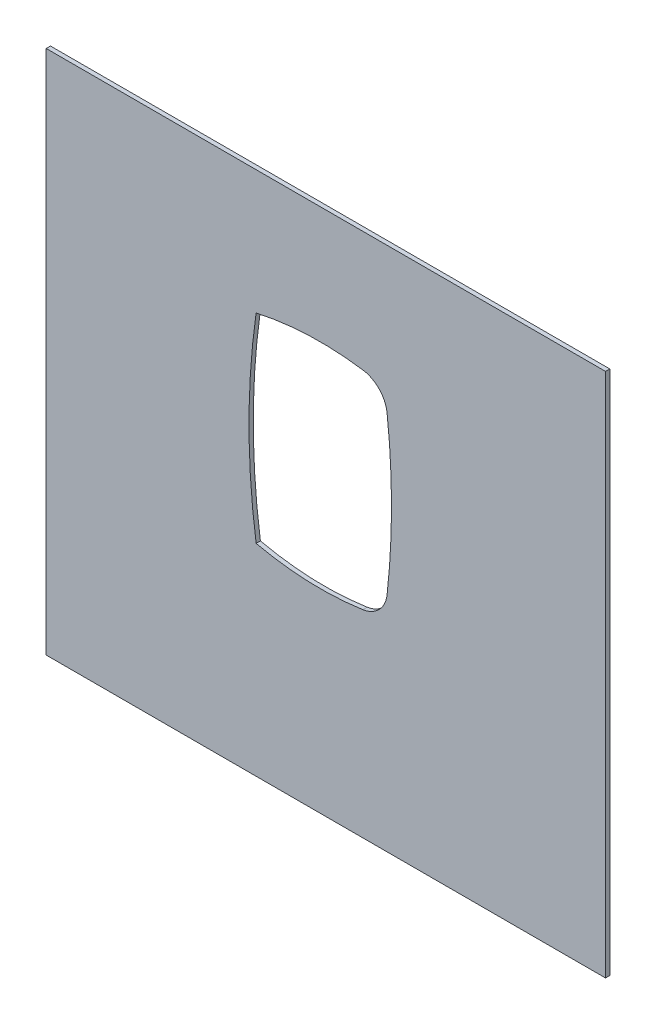
ISO-10303-21;
HEADER;
FILE_DESCRIPTION(('STEP AP214'),'2;1');
FILE_NAME('part.step','',(''),(''),'','','');
FILE_SCHEMA(('AUTOMOTIVE_DESIGN { 1 0 10303 214 1 1 1 1 }'));
ENDSEC;
DATA;
#1=APPLICATION_CONTEXT('core data for automotive mechanical design processes');
#2=APPLICATION_PROTOCOL_DEFINITION('international standard','automotive_design',2000,#1);
#3=PRODUCT_CONTEXT('',#1,'mechanical');
#4=PRODUCT('Part','Part','',(#3));
#5=PRODUCT_RELATED_PRODUCT_CATEGORY('part','',(#4));
#6=PRODUCT_DEFINITION_FORMATION('','',#4);
#7=PRODUCT_DEFINITION_CONTEXT('part definition',#1,'design');
#8=PRODUCT_DEFINITION('design','',#6,#7);
#9=PRODUCT_DEFINITION_SHAPE('','',#8);
#10=(LENGTH_UNIT() NAMED_UNIT(*) SI_UNIT(.MILLI.,.METRE.));
#11=(NAMED_UNIT(*) PLANE_ANGLE_UNIT() SI_UNIT($,.RADIAN.));
#12=(NAMED_UNIT(*) SI_UNIT($,.STERADIAN.) SOLID_ANGLE_UNIT());
#13=UNCERTAINTY_MEASURE_WITH_UNIT(LENGTH_MEASURE(1.E-05),#10,'distance_accuracy_value','');
#14=(GEOMETRIC_REPRESENTATION_CONTEXT(3) GLOBAL_UNCERTAINTY_ASSIGNED_CONTEXT((#13)) GLOBAL_UNIT_ASSIGNED_CONTEXT((#10,
#11,#12)) REPRESENTATION_CONTEXT('',''));
#15=CARTESIAN_POINT('',(0.,0.,0.));
#16=DIRECTION('',(0.,0.,1.));
#17=DIRECTION('',(1.,0.,0.));
#18=AXIS2_PLACEMENT_3D('',#15,#16,#17);
#19=CARTESIAN_POINT('',(0.,0.,3.));
#20=DIRECTION('',(0.,0.,1.));
#21=DIRECTION('',(1.,0.,0.));
#22=AXIS2_PLACEMENT_3D('',#19,#20,#21);
#23=PLANE('',#22);
#24=DIRECTION('',(0.,-1.,0.));
#25=VECTOR('',#24,1.);
#26=CARTESIAN_POINT('',(-192.273564140827,157.076579994882,3.));
#27=LINE('',#26,#25);
#28=CARTESIAN_POINT('',(-192.273564140827,157.076579994882,3.));
#29=VERTEX_POINT('',#28);
#30=CARTESIAN_POINT('',(-192.273564140827,-211.502758257767,3.));
#31=VERTEX_POINT('',#30);
#32=EDGE_CURVE('E161',#29,#31,#27,.T.);
#33=ORIENTED_EDGE('',*,*,#32,.T.);
#34=DIRECTION('',(1.,0.,0.));
#35=VECTOR('',#34,1.);
#36=CARTESIAN_POINT('',(-192.273564140827,-211.502758257767,3.));
#37=LINE('',#36,#35);
#38=CARTESIAN_POINT('',(200.136334774707,-211.502758257767,3.));
#39=VERTEX_POINT('',#38);
#40=EDGE_CURVE('E164',#31,#39,#37,.T.);
#41=ORIENTED_EDGE('',*,*,#40,.T.);
#42=DIRECTION('',(0.,1.,0.));
#43=VECTOR('',#42,1.);
#44=CARTESIAN_POINT('',(200.136334774707,157.076579994882,3.));
#45=LINE('',#44,#43);
#46=CARTESIAN_POINT('',(200.136334774707,157.076579994882,3.));
#47=VERTEX_POINT('',#46);
#48=EDGE_CURVE('E167',#39,#47,#45,.T.);
#49=ORIENTED_EDGE('',*,*,#48,.T.);
#50=DIRECTION('',(-1.,0.,0.));
#51=VECTOR('',#50,1.);
#52=CARTESIAN_POINT('',(-192.273564140827,157.076579994882,3.));
#53=LINE('',#52,#51);
#54=EDGE_CURVE('E169',#47,#29,#53,.T.);
#55=ORIENTED_EDGE('',*,*,#54,.T.);
#56=EDGE_LOOP('',(#33,#41,#49,#55));
#57=FACE_BOUND('',#56,.T.);
#58=CARTESIAN_POINT('',(0.,130.000000000001,3.));
#59=DIRECTION('',(0.,0.,1.));
#60=DIRECTION('',(1.,0.,0.));
#61=AXIS2_PLACEMENT_3D('',#58,#59,#60);
#62=CIRCLE('',#61,205.000000000001);
#63=CARTESIAN_POINT('',(-45.0000000000001,-70.0000000000001,3.));
#64=VERTEX_POINT('',#63);
#65=CARTESIAN_POINT('',(29.936886890584,-72.8023244524097,3.));
#66=VERTEX_POINT('',#65);
#67=EDGE_CURVE('E118',#64,#66,#62,.T.);
#68=ORIENTED_EDGE('',*,*,#67,.F.);
#69=CARTESIAN_POINT('',(442.5,0.,3.));
#70=DIRECTION('',(0.,0.,1.));
#71=DIRECTION('',(1.,0.,0.));
#72=AXIS2_PLACEMENT_3D('',#69,#70,#71);
#73=CIRCLE('',#72,492.500000000001);
#74=CARTESIAN_POINT('',(-45.0000000000018,69.9999999999999,3.));
#75=VERTEX_POINT('',#74);
#76=EDGE_CURVE('E110',#75,#64,#73,.T.);
#77=ORIENTED_EDGE('',*,*,#76,.F.);
#78=CARTESIAN_POINT('',(0.,-130.000000000001,3.));
#79=DIRECTION('',(0.,0.,1.));
#80=DIRECTION('',(1.,0.,0.));
#81=AXIS2_PLACEMENT_3D('',#78,#79,#80);
#82=CIRCLE('',#81,205.000000000001);
#83=CARTESIAN_POINT('',(29.9368868905842,72.8023244524097,3.));
#84=VERTEX_POINT('',#83);
#85=EDGE_CURVE('E139',#84,#75,#82,.T.);
#86=ORIENTED_EDGE('',*,*,#85,.F.);
#87=CARTESIAN_POINT('',(27.0162149988198,53.0167318229059,3.));
#88=DIRECTION('',(0.,0.,1.));
#89=DIRECTION('',(-1.,0.,0.));
#90=AXIS2_PLACEMENT_3D('',#87,#88,#89);
#91=CIRCLE('',#90,20.0000000000001);
#92=CARTESIAN_POINT('',(46.8899172209921,55.2608262916004,3.));
#93=VERTEX_POINT('',#92);
#94=EDGE_CURVE('E137',#93,#84,#91,.T.);
#95=ORIENTED_EDGE('',*,*,#94,.F.);
#96=CARTESIAN_POINT('',(-442.5,0.,3.));
#97=DIRECTION('',(0.,0.,1.));
#98=DIRECTION('',(1.,0.,0.));
#99=AXIS2_PLACEMENT_3D('',#96,#97,#98);
#100=CIRCLE('',#99,492.5);
#101=CARTESIAN_POINT('',(46.8899172209922,-55.2608262916006,3.));
#102=VERTEX_POINT('',#101);
#103=EDGE_CURVE('E133',#102,#93,#100,.T.);
#104=ORIENTED_EDGE('',*,*,#103,.F.);
#105=CARTESIAN_POINT('',(27.0162149988198,-53.0167318229061,3.));
#106=DIRECTION('',(0.,0.,1.));
#107=DIRECTION('',(1.,0.,0.));
#108=AXIS2_PLACEMENT_3D('',#105,#106,#107);
#109=CIRCLE('',#108,20.0000000000001);
#110=EDGE_CURVE('E131',#66,#102,#109,.T.);
#111=ORIENTED_EDGE('',*,*,#110,.F.);
#112=EDGE_LOOP('',(#68,#77,#86,#95,#104,#111));
#113=FACE_BOUND('',#112,.T.);
#114=ADVANCED_FACE('F33',(#57,#113),#23,.T.);
#115=CARTESIAN_POINT('',(0.,0.,0.));
#116=DIRECTION('',(0.,0.,1.));
#117=DIRECTION('',(1.,0.,0.));
#118=AXIS2_PLACEMENT_3D('',#115,#116,#117);
#119=PLANE('',#118);
#120=DIRECTION('',(0.,-1.,0.));
#121=VECTOR('',#120,1.);
#122=CARTESIAN_POINT('',(-192.273564140827,157.076579994882,0.));
#123=LINE('',#122,#121);
#124=CARTESIAN_POINT('',(-192.273564140827,157.076579994882,0.));
#125=VERTEX_POINT('',#124);
#126=CARTESIAN_POINT('',(-192.273564140827,-211.502758257767,0.));
#127=VERTEX_POINT('',#126);
#128=EDGE_CURVE('E126',#125,#127,#123,.T.);
#129=ORIENTED_EDGE('',*,*,#128,.F.);
#130=DIRECTION('',(-1.,0.,0.));
#131=VECTOR('',#130,1.);
#132=CARTESIAN_POINT('',(-192.273564140827,157.076579994882,0.));
#133=LINE('',#132,#131);
#134=CARTESIAN_POINT('',(200.136334774707,157.076579994882,0.));
#135=VERTEX_POINT('',#134);
#136=EDGE_CURVE('E165',#135,#125,#133,.T.);
#137=ORIENTED_EDGE('',*,*,#136,.F.);
#138=DIRECTION('',(0.,1.,0.));
#139=VECTOR('',#138,1.);
#140=CARTESIAN_POINT('',(200.136334774707,157.076579994882,0.));
#141=LINE('',#140,#139);
#142=CARTESIAN_POINT('',(200.136334774707,-211.502758257767,0.));
#143=VERTEX_POINT('',#142);
#144=EDGE_CURVE('E176',#143,#135,#141,.T.);
#145=ORIENTED_EDGE('',*,*,#144,.F.);
#146=DIRECTION('',(1.,0.,0.));
#147=VECTOR('',#146,1.);
#148=CARTESIAN_POINT('',(-192.273564140827,-211.502758257767,0.));
#149=LINE('',#148,#147);
#150=EDGE_CURVE('E174',#127,#143,#149,.T.);
#151=ORIENTED_EDGE('',*,*,#150,.F.);
#152=EDGE_LOOP('',(#129,#137,#145,#151));
#153=FACE_BOUND('',#152,.T.);
#154=CARTESIAN_POINT('',(442.5,0.,0.));
#155=DIRECTION('',(0.,0.,1.));
#156=DIRECTION('',(1.,0.,0.));
#157=AXIS2_PLACEMENT_3D('',#154,#155,#156);
#158=CIRCLE('',#157,492.500000000001);
#159=CARTESIAN_POINT('',(-45.0000000000018,69.9999999999999,0.));
#160=VERTEX_POINT('',#159);
#161=CARTESIAN_POINT('',(-45.0000000000001,-70.0000000000001,0.));
#162=VERTEX_POINT('',#161);
#163=EDGE_CURVE('E56',#160,#162,#158,.T.);
#164=ORIENTED_EDGE('',*,*,#163,.T.);
#165=CARTESIAN_POINT('',(0.,130.000000000001,0.));
#166=DIRECTION('',(0.,0.,1.));
#167=DIRECTION('',(1.,0.,0.));
#168=AXIS2_PLACEMENT_3D('',#165,#166,#167);
#169=CIRCLE('',#168,205.000000000001);
#170=CARTESIAN_POINT('',(29.936886890584,-72.8023244524097,0.));
#171=VERTEX_POINT('',#170);
#172=EDGE_CURVE('E125',#162,#171,#169,.T.);
#173=ORIENTED_EDGE('',*,*,#172,.T.);
#174=CARTESIAN_POINT('',(27.0162149988198,-53.0167318229061,0.));
#175=DIRECTION('',(0.,0.,1.));
#176=DIRECTION('',(1.,0.,0.));
#177=AXIS2_PLACEMENT_3D('',#174,#175,#176);
#178=CIRCLE('',#177,20.0000000000001);
#179=CARTESIAN_POINT('',(46.8899172209922,-55.2608262916006,0.));
#180=VERTEX_POINT('',#179);
#181=EDGE_CURVE('E143',#171,#180,#178,.T.);
#182=ORIENTED_EDGE('',*,*,#181,.T.);
#183=CARTESIAN_POINT('',(-442.5,0.,0.));
#184=DIRECTION('',(0.,0.,1.));
#185=DIRECTION('',(1.,0.,0.));
#186=AXIS2_PLACEMENT_3D('',#183,#184,#185);
#187=CIRCLE('',#186,492.5);
#188=CARTESIAN_POINT('',(46.8899172209921,55.2608262916004,0.));
#189=VERTEX_POINT('',#188);
#190=EDGE_CURVE('E146',#180,#189,#187,.T.);
#191=ORIENTED_EDGE('',*,*,#190,.T.);
#192=CARTESIAN_POINT('',(27.0162149988198,53.0167318229059,0.));
#193=DIRECTION('',(0.,0.,1.));
#194=DIRECTION('',(-1.,0.,0.));
#195=AXIS2_PLACEMENT_3D('',#192,#193,#194);
#196=CIRCLE('',#195,20.0000000000001);
#197=CARTESIAN_POINT('',(29.9368868905841,72.8023244524094,0.));
#198=VERTEX_POINT('',#197);
#199=EDGE_CURVE('E149',#189,#198,#196,.T.);
#200=ORIENTED_EDGE('',*,*,#199,.T.);
#201=CARTESIAN_POINT('',(0.,-130.000000000001,0.));
#202=DIRECTION('',(0.,0.,1.));
#203=DIRECTION('',(1.,0.,0.));
#204=AXIS2_PLACEMENT_3D('',#201,#202,#203);
#205=CIRCLE('',#204,205.000000000001);
#206=EDGE_CURVE('E119',#198,#160,#205,.T.);
#207=ORIENTED_EDGE('',*,*,#206,.T.);
#208=EDGE_LOOP('',(#164,#173,#182,#191,#200,#207));
#209=FACE_BOUND('',#208,.T.);
#210=ADVANCED_FACE('F194',(#153,#209),#119,.F.);
#211=CARTESIAN_POINT('',(-192.273564140827,157.076579994882,3.));
#212=DIRECTION('',(1.,0.,0.));
#213=DIRECTION('',(0.,0.,-1.));
#214=AXIS2_PLACEMENT_3D('',#211,#212,#213);
#215=PLANE('',#214);
#216=ORIENTED_EDGE('',*,*,#128,.T.);
#217=DIRECTION('',(0.,0.,-1.));
#218=VECTOR('',#217,1.);
#219=CARTESIAN_POINT('',(-192.273564140827,-211.502758257767,3.));
#220=LINE('',#219,#218);
#221=EDGE_CURVE('E11',#31,#127,#220,.T.);
#222=ORIENTED_EDGE('',*,*,#221,.F.);
#223=ORIENTED_EDGE('',*,*,#32,.F.);
#224=DIRECTION('',(0.,0.,-1.));
#225=VECTOR('',#224,1.);
#226=CARTESIAN_POINT('',(-192.273564140827,157.076579994882,3.));
#227=LINE('',#226,#225);
#228=EDGE_CURVE('E171',#29,#125,#227,.T.);
#229=ORIENTED_EDGE('',*,*,#228,.T.);
#230=EDGE_LOOP('',(#216,#222,#223,#229));
#231=FACE_BOUND('',#230,.T.);
#232=ADVANCED_FACE('F35',(#231),#215,.F.);
#233=CARTESIAN_POINT('',(-192.273564140827,-211.502758257767,3.));
#234=DIRECTION('',(0.,1.,0.));
#235=DIRECTION('',(0.,0.,1.));
#236=AXIS2_PLACEMENT_3D('',#233,#234,#235);
#237=PLANE('',#236);
#238=ORIENTED_EDGE('',*,*,#150,.T.);
#239=DIRECTION('',(0.,0.,-1.));
#240=VECTOR('',#239,1.);
#241=CARTESIAN_POINT('',(200.136334774707,-211.502758257767,3.));
#242=LINE('',#241,#240);
#243=EDGE_CURVE('E41',#39,#143,#242,.T.);
#244=ORIENTED_EDGE('',*,*,#243,.F.);
#245=ORIENTED_EDGE('',*,*,#40,.F.);
#246=ORIENTED_EDGE('',*,*,#221,.T.);
#247=EDGE_LOOP('',(#238,#244,#245,#246));
#248=FACE_BOUND('',#247,.T.);
#249=ADVANCED_FACE('F204',(#248),#237,.F.);
#250=CARTESIAN_POINT('',(200.136334774707,157.076579994882,3.));
#251=DIRECTION('',(-1.,0.,0.));
#252=DIRECTION('',(0.,0.,1.));
#253=AXIS2_PLACEMENT_3D('',#250,#251,#252);
#254=PLANE('',#253);
#255=ORIENTED_EDGE('',*,*,#144,.T.);
#256=DIRECTION('',(0.,0.,-1.));
#257=VECTOR('',#256,1.);
#258=CARTESIAN_POINT('',(200.136334774707,157.076579994882,3.));
#259=LINE('',#258,#257);
#260=EDGE_CURVE('E181',#47,#135,#259,.T.);
#261=ORIENTED_EDGE('',*,*,#260,.F.);
#262=ORIENTED_EDGE('',*,*,#48,.F.);
#263=ORIENTED_EDGE('',*,*,#243,.T.);
#264=EDGE_LOOP('',(#255,#261,#262,#263));
#265=FACE_BOUND('',#264,.T.);
#266=ADVANCED_FACE('F188',(#265),#254,.F.);
#267=CARTESIAN_POINT('',(-192.273564140827,157.076579994882,3.));
#268=DIRECTION('',(0.,-1.,0.));
#269=DIRECTION('',(0.,0.,-1.));
#270=AXIS2_PLACEMENT_3D('',#267,#268,#269);
#271=PLANE('',#270);
#272=ORIENTED_EDGE('',*,*,#136,.T.);
#273=ORIENTED_EDGE('',*,*,#228,.F.);
#274=ORIENTED_EDGE('',*,*,#54,.F.);
#275=ORIENTED_EDGE('',*,*,#260,.T.);
#276=EDGE_LOOP('',(#272,#273,#274,#275));
#277=FACE_BOUND('',#276,.T.);
#278=ADVANCED_FACE('F198',(#277),#271,.F.);
#279=CARTESIAN_POINT('',(442.5,0.,3.));
#280=DIRECTION('',(0.,0.,-1.));
#281=DIRECTION('',(-1.,0.,0.));
#282=AXIS2_PLACEMENT_3D('',#279,#280,#281);
#283=CYLINDRICAL_SURFACE('',#282,492.500000000001);
#284=ORIENTED_EDGE('',*,*,#163,.F.);
#285=DIRECTION('',(0.,0.,-1.));
#286=VECTOR('',#285,1.);
#287=CARTESIAN_POINT('',(-45.0000000000018,69.9999999999999,3.));
#288=LINE('',#287,#286);
#289=EDGE_CURVE('E114',#75,#160,#288,.T.);
#290=ORIENTED_EDGE('',*,*,#289,.F.);
#291=ORIENTED_EDGE('',*,*,#76,.T.);
#292=DIRECTION('',(0.,0.,-1.));
#293=VECTOR('',#292,1.);
#294=CARTESIAN_POINT('',(-45.0000000000001,-70.0000000000001,3.));
#295=LINE('',#294,#293);
#296=EDGE_CURVE('E113',#64,#162,#295,.T.);
#297=ORIENTED_EDGE('',*,*,#296,.T.);
#298=EDGE_LOOP('',(#284,#290,#291,#297));
#299=FACE_BOUND('',#298,.T.);
#300=ADVANCED_FACE('F112',(#299),#283,.F.);
#301=CARTESIAN_POINT('',(0.,130.000000000001,3.));
#302=DIRECTION('',(0.,0.,-1.));
#303=DIRECTION('',(-1.,0.,0.));
#304=AXIS2_PLACEMENT_3D('',#301,#302,#303);
#305=CYLINDRICAL_SURFACE('',#304,205.000000000001);
#306=ORIENTED_EDGE('',*,*,#172,.F.);
#307=ORIENTED_EDGE('',*,*,#296,.F.);
#308=ORIENTED_EDGE('',*,*,#67,.T.);
#309=DIRECTION('',(0.,0.,-1.));
#310=VECTOR('',#309,1.);
#311=CARTESIAN_POINT('',(29.936886890584,-72.8023244524097,3.));
#312=LINE('',#311,#310);
#313=EDGE_CURVE('E127',#66,#171,#312,.T.);
#314=ORIENTED_EDGE('',*,*,#313,.T.);
#315=EDGE_LOOP('',(#306,#307,#308,#314));
#316=FACE_BOUND('',#315,.T.);
#317=ADVANCED_FACE('F122',(#316),#305,.F.);
#318=CARTESIAN_POINT('',(27.0162149988198,-53.0167318229061,3.));
#319=DIRECTION('',(0.,0.,-1.));
#320=DIRECTION('',(-1.,0.,0.));
#321=AXIS2_PLACEMENT_3D('',#318,#319,#320);
#322=CYLINDRICAL_SURFACE('',#321,20.0000000000001);
#323=ORIENTED_EDGE('',*,*,#181,.F.);
#324=ORIENTED_EDGE('',*,*,#313,.F.);
#325=ORIENTED_EDGE('',*,*,#110,.T.);
#326=DIRECTION('',(0.,0.,-1.));
#327=VECTOR('',#326,1.);
#328=CARTESIAN_POINT('',(46.8899172209922,-55.2608262916006,3.));
#329=LINE('',#328,#327);
#330=EDGE_CURVE('E158',#102,#180,#329,.T.);
#331=ORIENTED_EDGE('',*,*,#330,.T.);
#332=EDGE_LOOP('',(#323,#324,#325,#331));
#333=FACE_BOUND('',#332,.T.);
#334=ADVANCED_FACE('F227',(#333),#322,.F.);
#335=CARTESIAN_POINT('',(-442.5,0.,3.));
#336=DIRECTION('',(0.,0.,-1.));
#337=DIRECTION('',(-1.,0.,0.));
#338=AXIS2_PLACEMENT_3D('',#335,#336,#337);
#339=CYLINDRICAL_SURFACE('',#338,492.5);
#340=ORIENTED_EDGE('',*,*,#190,.F.);
#341=ORIENTED_EDGE('',*,*,#330,.F.);
#342=ORIENTED_EDGE('',*,*,#103,.T.);
#343=DIRECTION('',(0.,0.,-1.));
#344=VECTOR('',#343,1.);
#345=CARTESIAN_POINT('',(46.8899172209921,55.2608262916004,3.));
#346=LINE('',#345,#344);
#347=EDGE_CURVE('E156',#93,#189,#346,.T.);
#348=ORIENTED_EDGE('',*,*,#347,.T.);
#349=EDGE_LOOP('',(#340,#341,#342,#348));
#350=FACE_BOUND('',#349,.T.);
#351=ADVANCED_FACE('F231',(#350),#339,.F.);
#352=CARTESIAN_POINT('',(27.0162149988198,53.0167318229059,3.));
#353=DIRECTION('',(0.,0.,-1.));
#354=DIRECTION('',(-1.,0.,0.));
#355=AXIS2_PLACEMENT_3D('',#352,#353,#354);
#356=CYLINDRICAL_SURFACE('',#355,20.0000000000001);
#357=ORIENTED_EDGE('',*,*,#199,.F.);
#358=ORIENTED_EDGE('',*,*,#347,.F.);
#359=ORIENTED_EDGE('',*,*,#94,.T.);
#360=DIRECTION('',(0.,0.,-1.));
#361=VECTOR('',#360,1.);
#362=CARTESIAN_POINT('',(29.9368868905841,72.8023244524094,3.));
#363=LINE('',#362,#361);
#364=EDGE_CURVE('E48',#84,#198,#363,.T.);
#365=ORIENTED_EDGE('',*,*,#364,.T.);
#366=EDGE_LOOP('',(#357,#358,#359,#365));
#367=FACE_BOUND('',#366,.T.);
#368=ADVANCED_FACE('F237',(#367),#356,.F.);
#369=CARTESIAN_POINT('',(0.,-130.000000000001,3.));
#370=DIRECTION('',(0.,0.,-1.));
#371=DIRECTION('',(-1.,0.,0.));
#372=AXIS2_PLACEMENT_3D('',#369,#370,#371);
#373=CYLINDRICAL_SURFACE('',#372,205.000000000001);
#374=ORIENTED_EDGE('',*,*,#206,.F.);
#375=ORIENTED_EDGE('',*,*,#364,.F.);
#376=ORIENTED_EDGE('',*,*,#85,.T.);
#377=ORIENTED_EDGE('',*,*,#289,.T.);
#378=EDGE_LOOP('',(#374,#375,#376,#377));
#379=FACE_BOUND('',#378,.T.);
#380=ADVANCED_FACE('F241',(#379),#373,.F.);
#381=CLOSED_SHELL('',(#114,#210,#232,#249,#266,#278,#300,#317,#334,#351,#368,#380));
#382=MANIFOLD_SOLID_BREP('B2',#381);
#383=ADVANCED_BREP_SHAPE_REPRESENTATION('',(#18,#382),#14);
#384=SHAPE_DEFINITION_REPRESENTATION(#9,#383);
ENDSEC;
END-ISO-10303-21;
